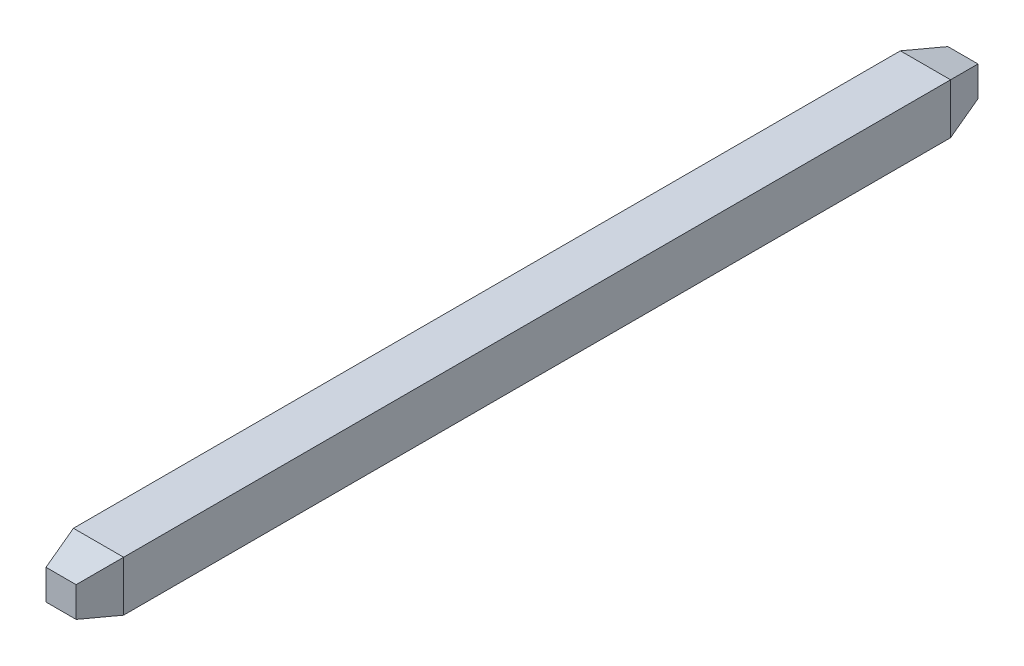
ISO-10303-21;
HEADER;
FILE_DESCRIPTION(('STEP AP214'),'2;1');
FILE_NAME('part.step','',(''),(''),'','','');
FILE_SCHEMA(('AUTOMOTIVE_DESIGN { 1 0 10303 214 1 1 1 1 }'));
ENDSEC;
DATA;
#1=APPLICATION_CONTEXT('core data for automotive mechanical design processes');
#2=APPLICATION_PROTOCOL_DEFINITION('international standard','automotive_design',2000,#1);
#3=PRODUCT_CONTEXT('',#1,'mechanical');
#4=PRODUCT('Part','Part','',(#3));
#5=PRODUCT_RELATED_PRODUCT_CATEGORY('part','',(#4));
#6=PRODUCT_DEFINITION_FORMATION('','',#4);
#7=PRODUCT_DEFINITION_CONTEXT('part definition',#1,'design');
#8=PRODUCT_DEFINITION('design','',#6,#7);
#9=PRODUCT_DEFINITION_SHAPE('','',#8);
#10=(LENGTH_UNIT() NAMED_UNIT(*) SI_UNIT(.MILLI.,.METRE.));
#11=(NAMED_UNIT(*) PLANE_ANGLE_UNIT() SI_UNIT($,.RADIAN.));
#12=(NAMED_UNIT(*) SI_UNIT($,.STERADIAN.) SOLID_ANGLE_UNIT());
#13=UNCERTAINTY_MEASURE_WITH_UNIT(LENGTH_MEASURE(1.E-05),#10,'distance_accuracy_value','');
#14=(GEOMETRIC_REPRESENTATION_CONTEXT(3) GLOBAL_UNCERTAINTY_ASSIGNED_CONTEXT((#13)) GLOBAL_UNIT_ASSIGNED_CONTEXT((#10,
#11,#12)) REPRESENTATION_CONTEXT('',''));
#15=CARTESIAN_POINT('',(0.,0.,0.));
#16=DIRECTION('',(0.,0.,1.));
#17=DIRECTION('',(1.,0.,0.));
#18=AXIS2_PLACEMENT_3D('',#15,#16,#17);
#19=CARTESIAN_POINT('',(3.54859499326237,2.21999999999993,7.92229749663118));
#20=DIRECTION('',(0.,-0.965925826289069,0.25881904510252));
#21=DIRECTION('',(0.,-0.25881904510252,-0.965925826289069));
#22=AXIS2_PLACEMENT_3D('',#19,#20,#21);
#23=PLANE('',#22);
#24=DIRECTION('',(1.,0.,0.));
#25=VECTOR('',#24,1.);
#26=CARTESIAN_POINT('',(5.08,2.34799999999993,8.4));
#27=LINE('',#26,#25);
#28=CARTESIAN_POINT('',(4.888,2.34799999999993,8.4));
#29=VERTEX_POINT('',#28);
#30=CARTESIAN_POINT('',(5.272,2.34799999999993,8.4));
#31=VERTEX_POINT('',#30);
#32=EDGE_CURVE('E20',#29,#31,#27,.T.);
#33=ORIENTED_EDGE('',*,*,#32,.F.);
#34=DIRECTION('',(0.250562807085731,0.25056280708573,0.93511312653103));
#35=VECTOR('',#34,1.);
#36=CARTESIAN_POINT('',(4.76,2.21999999999993,7.92229749663118));
#37=LINE('',#36,#35);
#38=CARTESIAN_POINT('',(4.76,2.21999999999993,7.92229749663118));
#39=VERTEX_POINT('',#38);
#40=EDGE_CURVE('E110',#39,#29,#37,.T.);
#41=ORIENTED_EDGE('',*,*,#40,.F.);
#42=DIRECTION('',(1.,0.,0.));
#43=VECTOR('',#42,1.);
#44=CARTESIAN_POINT('',(4.76,2.21999999999993,7.92229749663118));
#45=LINE('',#44,#43);
#46=CARTESIAN_POINT('',(5.4,2.21999999999993,7.92229749663118));
#47=VERTEX_POINT('',#46);
#48=EDGE_CURVE('E96',#47,#39,#45,.F.);
#49=ORIENTED_EDGE('',*,*,#48,.F.);
#50=DIRECTION('',(0.250562807085732,-0.25056280708573,-0.93511312653103));
#51=VECTOR('',#50,1.);
#52=CARTESIAN_POINT('',(5.272,2.34799999999993,8.4));
#53=LINE('',#52,#51);
#54=EDGE_CURVE('E94',#31,#47,#53,.T.);
#55=ORIENTED_EDGE('',*,*,#54,.F.);
#56=EDGE_LOOP('',(#33,#41,#49,#55));
#57=FACE_BOUND('',#56,.T.);
#58=ADVANCED_FACE('F17',(#57),#23,.T.);
#59=CARTESIAN_POINT('',(3.54859499326237,2.21999999999993,-2.62229749663118));
#60=DIRECTION('',(0.,0.965925826289068,0.258819045102521));
#61=DIRECTION('',(0.,-0.258819045102521,0.965925826289068));
#62=AXIS2_PLACEMENT_3D('',#59,#60,#61);
#63=PLANE('',#62);
#64=DIRECTION('',(0.250562807085732,0.25056280708573,-0.93511312653103));
#65=VECTOR('',#64,1.);
#66=CARTESIAN_POINT('',(4.76,2.21999999999993,-2.62229749663118));
#67=LINE('',#66,#65);
#68=CARTESIAN_POINT('',(4.76,2.21999999999993,-2.62229749663118));
#69=VERTEX_POINT('',#68);
#70=CARTESIAN_POINT('',(4.888,2.34799999999993,-3.1));
#71=VERTEX_POINT('',#70);
#72=EDGE_CURVE('E113',#69,#71,#67,.T.);
#73=ORIENTED_EDGE('',*,*,#72,.T.);
#74=DIRECTION('',(1.,0.,0.));
#75=VECTOR('',#74,1.);
#76=CARTESIAN_POINT('',(5.08,2.34799999999993,-3.1));
#77=LINE('',#76,#75);
#78=CARTESIAN_POINT('',(5.272,2.34799999999993,-3.1));
#79=VERTEX_POINT('',#78);
#80=EDGE_CURVE('E79',#71,#79,#77,.T.);
#81=ORIENTED_EDGE('',*,*,#80,.T.);
#82=DIRECTION('',(0.250562807085734,-0.25056280708573,0.935113126531029));
#83=VECTOR('',#82,1.);
#84=CARTESIAN_POINT('',(5.272,2.34799999999993,-3.1));
#85=LINE('',#84,#83);
#86=CARTESIAN_POINT('',(5.4,2.21999999999993,-2.62229749663118));
#87=VERTEX_POINT('',#86);
#88=EDGE_CURVE('E108',#79,#87,#85,.T.);
#89=ORIENTED_EDGE('',*,*,#88,.T.);
#90=DIRECTION('',(1.,0.,0.));
#91=VECTOR('',#90,1.);
#92=CARTESIAN_POINT('',(4.76,2.21999999999993,-2.62229749663118));
#93=LINE('',#92,#91);
#94=EDGE_CURVE('E118',#69,#87,#93,.T.);
#95=ORIENTED_EDGE('',*,*,#94,.F.);
#96=EDGE_LOOP('',(#73,#81,#89,#95));
#97=FACE_BOUND('',#96,.T.);
#98=ADVANCED_FACE('F281',(#97),#63,.F.);
#99=CARTESIAN_POINT('',(5.08,2.53999999999993,8.4));
#100=DIRECTION('',(0.,0.,1.));
#101=DIRECTION('',(1.,0.,0.));
#102=AXIS2_PLACEMENT_3D('',#99,#100,#101);
#103=PLANE('',#102);
#104=ORIENTED_EDGE('',*,*,#32,.T.);
#105=DIRECTION('',(0.,1.,0.));
#106=VECTOR('',#105,1.);
#107=CARTESIAN_POINT('',(5.272,1.0085949932623,8.4));
#108=LINE('',#107,#106);
#109=CARTESIAN_POINT('',(5.272,2.73199999999993,8.4));
#110=VERTEX_POINT('',#109);
#111=EDGE_CURVE('E88',#110,#31,#108,.F.);
#112=ORIENTED_EDGE('',*,*,#111,.F.);
#113=DIRECTION('',(1.,0.,0.));
#114=VECTOR('',#113,1.);
#115=CARTESIAN_POINT('',(6.61140500673763,2.73199999999993,8.4));
#116=LINE('',#115,#114);
#117=CARTESIAN_POINT('',(4.888,2.73199999999993,8.4));
#118=VERTEX_POINT('',#117);
#119=EDGE_CURVE('E124',#118,#110,#116,.T.);
#120=ORIENTED_EDGE('',*,*,#119,.F.);
#121=DIRECTION('',(0.,1.,0.));
#122=VECTOR('',#121,1.);
#123=CARTESIAN_POINT('',(4.888,4.07140500673756,8.4));
#124=LINE('',#123,#122);
#125=EDGE_CURVE('E90',#29,#118,#124,.T.);
#126=ORIENTED_EDGE('',*,*,#125,.F.);
#127=EDGE_LOOP('',(#104,#112,#120,#126));
#128=FACE_BOUND('',#127,.T.);
#129=ADVANCED_FACE('F85',(#128),#103,.T.);
#130=CARTESIAN_POINT('',(5.4,1.0085949932623,7.92229749663118));
#131=DIRECTION('',(0.965925826289069,0.,0.25881904510252));
#132=DIRECTION('',(0.25881904510252,0.,-0.965925826289069));
#133=AXIS2_PLACEMENT_3D('',#130,#131,#132);
#134=PLANE('',#133);
#135=ORIENTED_EDGE('',*,*,#111,.T.);
#136=ORIENTED_EDGE('',*,*,#54,.T.);
#137=DIRECTION('',(0.,1.,0.));
#138=VECTOR('',#137,1.);
#139=CARTESIAN_POINT('',(5.4,2.21999999999993,7.92229749663118));
#140=LINE('',#139,#138);
#141=CARTESIAN_POINT('',(5.4,2.85999999999993,7.92229749663118));
#142=VERTEX_POINT('',#141);
#143=EDGE_CURVE('E127',#142,#47,#140,.F.);
#144=ORIENTED_EDGE('',*,*,#143,.F.);
#145=DIRECTION('',(0.250562807085729,0.250562807085731,-0.93511312653103));
#146=VECTOR('',#145,1.);
#147=CARTESIAN_POINT('',(5.272,2.73199999999993,8.4));
#148=LINE('',#147,#146);
#149=EDGE_CURVE('E102',#110,#142,#148,.T.);
#150=ORIENTED_EDGE('',*,*,#149,.F.);
#151=EDGE_LOOP('',(#135,#136,#144,#150));
#152=FACE_BOUND('',#151,.T.);
#153=ADVANCED_FACE('F100',(#152),#134,.T.);
#154=CARTESIAN_POINT('',(5.08,2.53999999999993,-3.1));
#155=DIRECTION('',(0.,0.,1.));
#156=DIRECTION('',(1.,0.,0.));
#157=AXIS2_PLACEMENT_3D('',#154,#155,#156);
#158=PLANE('',#157);
#159=DIRECTION('',(0.,1.,0.));
#160=VECTOR('',#159,1.);
#161=CARTESIAN_POINT('',(5.272,1.0085949932623,-3.1));
#162=LINE('',#161,#160);
#163=CARTESIAN_POINT('',(5.272,2.73199999999993,-3.1));
#164=VERTEX_POINT('',#163);
#165=EDGE_CURVE('E106',#164,#79,#162,.F.);
#166=ORIENTED_EDGE('',*,*,#165,.T.);
#167=ORIENTED_EDGE('',*,*,#80,.F.);
#168=DIRECTION('',(0.,1.,0.));
#169=VECTOR('',#168,1.);
#170=CARTESIAN_POINT('',(4.888,4.07140500673756,-3.1));
#171=LINE('',#170,#169);
#172=CARTESIAN_POINT('',(4.888,2.73199999999993,-3.1));
#173=VERTEX_POINT('',#172);
#174=EDGE_CURVE('E115',#71,#173,#171,.T.);
#175=ORIENTED_EDGE('',*,*,#174,.T.);
#176=DIRECTION('',(1.,0.,0.));
#177=VECTOR('',#176,1.);
#178=CARTESIAN_POINT('',(6.61140500673763,2.73199999999993,-3.1));
#179=LINE('',#178,#177);
#180=EDGE_CURVE('E138',#173,#164,#179,.T.);
#181=ORIENTED_EDGE('',*,*,#180,.T.);
#182=EDGE_LOOP('',(#166,#167,#175,#181));
#183=FACE_BOUND('',#182,.T.);
#184=ADVANCED_FACE('F257',(#183),#158,.F.);
#185=CARTESIAN_POINT('',(5.4,1.0085949932623,-2.62229749663118));
#186=DIRECTION('',(-0.965925826289068,0.,0.258819045102521));
#187=DIRECTION('',(0.258819045102521,0.,0.965925826289068));
#188=AXIS2_PLACEMENT_3D('',#185,#186,#187);
#189=PLANE('',#188);
#190=ORIENTED_EDGE('',*,*,#88,.F.);
#191=ORIENTED_EDGE('',*,*,#165,.F.);
#192=DIRECTION('',(0.250562807085729,0.250562807085732,0.93511312653103));
#193=VECTOR('',#192,1.);
#194=CARTESIAN_POINT('',(5.272,2.73199999999993,-3.1));
#195=LINE('',#194,#193);
#196=CARTESIAN_POINT('',(5.4,2.85999999999993,-2.62229749663118));
#197=VERTEX_POINT('',#196);
#198=EDGE_CURVE('E140',#164,#197,#195,.T.);
#199=ORIENTED_EDGE('',*,*,#198,.T.);
#200=DIRECTION('',(0.,1.,0.));
#201=VECTOR('',#200,1.);
#202=CARTESIAN_POINT('',(5.4,2.21999999999993,-2.62229749663118));
#203=LINE('',#202,#201);
#204=EDGE_CURVE('E133',#87,#197,#203,.T.);
#205=ORIENTED_EDGE('',*,*,#204,.F.);
#206=EDGE_LOOP('',(#190,#191,#199,#205));
#207=FACE_BOUND('',#206,.T.);
#208=ADVANCED_FACE('F249',(#207),#189,.F.);
#209=CARTESIAN_POINT('',(4.76,4.07140500673756,7.92229749663118));
#210=DIRECTION('',(-0.965925826289069,0.,0.25881904510252));
#211=DIRECTION('',(0.25881904510252,0.,0.965925826289069));
#212=AXIS2_PLACEMENT_3D('',#209,#210,#211);
#213=PLANE('',#212);
#214=ORIENTED_EDGE('',*,*,#125,.T.);
#215=DIRECTION('',(0.25056280708573,-0.25056280708573,0.93511312653103));
#216=VECTOR('',#215,1.);
#217=CARTESIAN_POINT('',(4.76,2.85999999999993,7.92229749663118));
#218=LINE('',#217,#216);
#219=CARTESIAN_POINT('',(4.76,2.85999999999993,7.92229749663118));
#220=VERTEX_POINT('',#219);
#221=EDGE_CURVE('E121',#220,#118,#218,.T.);
#222=ORIENTED_EDGE('',*,*,#221,.F.);
#223=DIRECTION('',(0.,-1.,0.));
#224=VECTOR('',#223,1.);
#225=CARTESIAN_POINT('',(4.76,2.85999999999993,7.92229749663118));
#226=LINE('',#225,#224);
#227=EDGE_CURVE('E142',#39,#220,#226,.F.);
#228=ORIENTED_EDGE('',*,*,#227,.F.);
#229=ORIENTED_EDGE('',*,*,#40,.T.);
#230=EDGE_LOOP('',(#214,#222,#228,#229));
#231=FACE_BOUND('',#230,.T.);
#232=ADVANCED_FACE('F171',(#231),#213,.T.);
#233=CARTESIAN_POINT('',(4.76,4.07140500673756,-2.62229749663118));
#234=DIRECTION('',(0.965925826289068,0.,0.258819045102521));
#235=DIRECTION('',(0.258819045102521,0.,-0.965925826289068));
#236=AXIS2_PLACEMENT_3D('',#233,#234,#235);
#237=PLANE('',#236);
#238=DIRECTION('',(0.25056280708573,-0.250562807085732,-0.93511312653103));
#239=VECTOR('',#238,1.);
#240=CARTESIAN_POINT('',(4.76,2.85999999999993,-2.62229749663118));
#241=LINE('',#240,#239);
#242=CARTESIAN_POINT('',(4.76,2.85999999999993,-2.62229749663118));
#243=VERTEX_POINT('',#242);
#244=EDGE_CURVE('E136',#243,#173,#241,.T.);
#245=ORIENTED_EDGE('',*,*,#244,.T.);
#246=ORIENTED_EDGE('',*,*,#174,.F.);
#247=ORIENTED_EDGE('',*,*,#72,.F.);
#248=DIRECTION('',(0.,-1.,0.));
#249=VECTOR('',#248,1.);
#250=CARTESIAN_POINT('',(4.76,2.85999999999993,-2.62229749663118));
#251=LINE('',#250,#249);
#252=EDGE_CURVE('E35',#243,#69,#251,.T.);
#253=ORIENTED_EDGE('',*,*,#252,.F.);
#254=EDGE_LOOP('',(#245,#246,#247,#253));
#255=FACE_BOUND('',#254,.T.);
#256=ADVANCED_FACE('F188',(#255),#237,.F.);
#257=CARTESIAN_POINT('',(4.76,2.21999999999993,-3.1));
#258=DIRECTION('',(0.,-1.,0.));
#259=DIRECTION('',(1.,0.,0.));
#260=AXIS2_PLACEMENT_3D('',#257,#258,#259);
#261=PLANE('',#260);
#262=ORIENTED_EDGE('',*,*,#94,.T.);
#263=DIRECTION('',(0.,0.,1.));
#264=VECTOR('',#263,1.);
#265=CARTESIAN_POINT('',(5.4,2.21999999999993,-3.1));
#266=LINE('',#265,#264);
#267=EDGE_CURVE('E130',#47,#87,#266,.F.);
#268=ORIENTED_EDGE('',*,*,#267,.F.);
#269=ORIENTED_EDGE('',*,*,#48,.T.);
#270=DIRECTION('',(0.,0.,1.));
#271=VECTOR('',#270,1.);
#272=CARTESIAN_POINT('',(4.76,2.21999999999993,-3.1));
#273=LINE('',#272,#271);
#274=EDGE_CURVE('E146',#69,#39,#273,.T.);
#275=ORIENTED_EDGE('',*,*,#274,.F.);
#276=EDGE_LOOP('',(#262,#268,#269,#275));
#277=FACE_BOUND('',#276,.T.);
#278=ADVANCED_FACE('F174',(#277),#261,.T.);
#279=CARTESIAN_POINT('',(6.61140500673763,2.85999999999993,7.92229749663118));
#280=DIRECTION('',(0.,0.965925826289069,0.25881904510252));
#281=DIRECTION('',(0.,-0.25881904510252,0.965925826289069));
#282=AXIS2_PLACEMENT_3D('',#279,#280,#281);
#283=PLANE('',#282);
#284=ORIENTED_EDGE('',*,*,#119,.T.);
#285=ORIENTED_EDGE('',*,*,#149,.T.);
#286=DIRECTION('',(-1.,0.,0.));
#287=VECTOR('',#286,1.);
#288=CARTESIAN_POINT('',(5.4,2.85999999999993,7.92229749663118));
#289=LINE('',#288,#287);
#290=EDGE_CURVE('E149',#220,#142,#289,.F.);
#291=ORIENTED_EDGE('',*,*,#290,.F.);
#292=ORIENTED_EDGE('',*,*,#221,.T.);
#293=EDGE_LOOP('',(#284,#285,#291,#292));
#294=FACE_BOUND('',#293,.T.);
#295=ADVANCED_FACE('F179',(#294),#283,.T.);
#296=CARTESIAN_POINT('',(5.4,2.21999999999993,-3.1));
#297=DIRECTION('',(1.,0.,0.));
#298=DIRECTION('',(0.,1.,0.));
#299=AXIS2_PLACEMENT_3D('',#296,#297,#298);
#300=PLANE('',#299);
#301=ORIENTED_EDGE('',*,*,#204,.T.);
#302=DIRECTION('',(0.,0.,1.));
#303=VECTOR('',#302,1.);
#304=CARTESIAN_POINT('',(5.4,2.85999999999993,-3.1));
#305=LINE('',#304,#303);
#306=EDGE_CURVE('E152',#142,#197,#305,.F.);
#307=ORIENTED_EDGE('',*,*,#306,.F.);
#308=ORIENTED_EDGE('',*,*,#143,.T.);
#309=ORIENTED_EDGE('',*,*,#267,.T.);
#310=EDGE_LOOP('',(#301,#307,#308,#309));
#311=FACE_BOUND('',#310,.T.);
#312=ADVANCED_FACE('F177',(#311),#300,.T.);
#313=CARTESIAN_POINT('',(6.61140500673763,2.85999999999993,-2.62229749663118));
#314=DIRECTION('',(0.,-0.965925826289068,0.258819045102521));
#315=DIRECTION('',(0.,-0.258819045102521,-0.965925826289068));
#316=AXIS2_PLACEMENT_3D('',#313,#314,#315);
#317=PLANE('',#316);
#318=ORIENTED_EDGE('',*,*,#198,.F.);
#319=ORIENTED_EDGE('',*,*,#180,.F.);
#320=ORIENTED_EDGE('',*,*,#244,.F.);
#321=DIRECTION('',(-1.,0.,0.));
#322=VECTOR('',#321,1.);
#323=CARTESIAN_POINT('',(5.4,2.85999999999993,-2.62229749663118));
#324=LINE('',#323,#322);
#325=EDGE_CURVE('E26',#197,#243,#324,.T.);
#326=ORIENTED_EDGE('',*,*,#325,.F.);
#327=EDGE_LOOP('',(#318,#319,#320,#326));
#328=FACE_BOUND('',#327,.T.);
#329=ADVANCED_FACE('F163',(#328),#317,.F.);
#330=CARTESIAN_POINT('',(4.76,2.85999999999993,-3.1));
#331=DIRECTION('',(-1.,0.,0.));
#332=DIRECTION('',(0.,-1.,0.));
#333=AXIS2_PLACEMENT_3D('',#330,#331,#332);
#334=PLANE('',#333);
#335=ORIENTED_EDGE('',*,*,#252,.T.);
#336=ORIENTED_EDGE('',*,*,#274,.T.);
#337=ORIENTED_EDGE('',*,*,#227,.T.);
#338=DIRECTION('',(0.,0.,1.));
#339=VECTOR('',#338,1.);
#340=CARTESIAN_POINT('',(4.76,2.85999999999993,-3.1));
#341=LINE('',#340,#339);
#342=EDGE_CURVE('E11',#243,#220,#341,.T.);
#343=ORIENTED_EDGE('',*,*,#342,.F.);
#344=EDGE_LOOP('',(#335,#336,#337,#343));
#345=FACE_BOUND('',#344,.T.);
#346=ADVANCED_FACE('F167',(#345),#334,.T.);
#347=CARTESIAN_POINT('',(5.4,2.85999999999993,-3.1));
#348=DIRECTION('',(0.,1.,0.));
#349=DIRECTION('',(-1.,0.,0.));
#350=AXIS2_PLACEMENT_3D('',#347,#348,#349);
#351=PLANE('',#350);
#352=ORIENTED_EDGE('',*,*,#325,.T.);
#353=ORIENTED_EDGE('',*,*,#342,.T.);
#354=ORIENTED_EDGE('',*,*,#290,.T.);
#355=ORIENTED_EDGE('',*,*,#306,.T.);
#356=EDGE_LOOP('',(#352,#353,#354,#355));
#357=FACE_BOUND('',#356,.T.);
#358=ADVANCED_FACE('F158',(#357),#351,.T.);
#359=CLOSED_SHELL('',(#58,#98,#129,#153,#184,#208,#232,#256,#278,#295,#312,#329,#346,#358));
#360=MANIFOLD_SOLID_BREP('B1',#359);
#361=ADVANCED_BREP_SHAPE_REPRESENTATION('',(#18,#360),#14);
#362=SHAPE_DEFINITION_REPRESENTATION(#9,#361);
ENDSEC;
END-ISO-10303-21;
